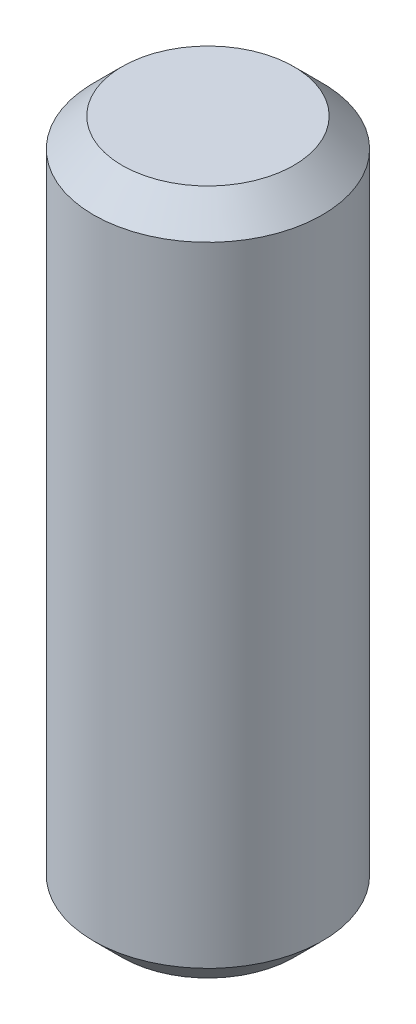
ISO-10303-21;
HEADER;
FILE_DESCRIPTION(('STEP AP214'),'2;1');
FILE_NAME('part.step','',(''),(''),'','','');
FILE_SCHEMA(('AUTOMOTIVE_DESIGN { 1 0 10303 214 1 1 1 1 }'));
ENDSEC;
DATA;
#1=APPLICATION_CONTEXT('core data for automotive mechanical design processes');
#2=APPLICATION_PROTOCOL_DEFINITION('international standard','automotive_design',2000,#1);
#3=PRODUCT_CONTEXT('',#1,'mechanical');
#4=PRODUCT('Part','Part','',(#3));
#5=PRODUCT_RELATED_PRODUCT_CATEGORY('part','',(#4));
#6=PRODUCT_DEFINITION_FORMATION('','',#4);
#7=PRODUCT_DEFINITION_CONTEXT('part definition',#1,'design');
#8=PRODUCT_DEFINITION('design','',#6,#7);
#9=PRODUCT_DEFINITION_SHAPE('','',#8);
#10=(LENGTH_UNIT() NAMED_UNIT(*) SI_UNIT(.MILLI.,.METRE.));
#11=(NAMED_UNIT(*) PLANE_ANGLE_UNIT() SI_UNIT($,.RADIAN.));
#12=(NAMED_UNIT(*) SI_UNIT($,.STERADIAN.) SOLID_ANGLE_UNIT());
#13=UNCERTAINTY_MEASURE_WITH_UNIT(LENGTH_MEASURE(1.E-05),#10,'distance_accuracy_value','');
#14=(GEOMETRIC_REPRESENTATION_CONTEXT(3) GLOBAL_UNCERTAINTY_ASSIGNED_CONTEXT((#13)) GLOBAL_UNIT_ASSIGNED_CONTEXT((#10,
#11,#12)) REPRESENTATION_CONTEXT('',''));
#15=CARTESIAN_POINT('',(0.,0.,0.));
#16=DIRECTION('',(0.,0.,1.));
#17=DIRECTION('',(1.,0.,0.));
#18=AXIS2_PLACEMENT_3D('',#15,#16,#17);
#19=CARTESIAN_POINT('',(0.,12.,0.));
#20=DIRECTION('',(0.,-1.,0.));
#21=DIRECTION('',(0.,0.,-1.));
#22=AXIS2_PLACEMENT_3D('',#19,#20,#21);
#23=CYLINDRICAL_SURFACE('',#22,2.);
#24=CARTESIAN_POINT('',(0.,0.500000000000002,0.));
#25=DIRECTION('',(0.,1.,0.));
#26=DIRECTION('',(0.,0.,1.));
#27=AXIS2_PLACEMENT_3D('',#24,#25,#26);
#28=CIRCLE('',#27,2.);
#29=CARTESIAN_POINT('',(0.,0.500000000000002,2.));
#30=VERTEX_POINT('',#29);
#31=EDGE_CURVE('E51',#30,#30,#28,.T.);
#32=ORIENTED_EDGE('',*,*,#31,.T.);
#33=EDGE_LOOP('',(#32));
#34=FACE_BOUND('',#33,.T.);
#35=CARTESIAN_POINT('',(0.,11.5,0.));
#36=DIRECTION('',(0.,1.,0.));
#37=DIRECTION('',(0.,0.,1.));
#38=AXIS2_PLACEMENT_3D('',#35,#36,#37);
#39=CIRCLE('',#38,2.);
#40=CARTESIAN_POINT('',(0.,11.5,2.));
#41=VERTEX_POINT('',#40);
#42=EDGE_CURVE('E55',#41,#41,#39,.F.);
#43=ORIENTED_EDGE('',*,*,#42,.T.);
#44=EDGE_LOOP('',(#43));
#45=FACE_BOUND('',#44,.T.);
#46=ADVANCED_FACE('F39',(#34,#45),#23,.T.);
#47=CARTESIAN_POINT('',(0.,12.,0.));
#48=DIRECTION('',(0.,1.,0.));
#49=DIRECTION('',(0.,0.,1.));
#50=AXIS2_PLACEMENT_3D('',#47,#48,#49);
#51=PLANE('',#50);
#52=CARTESIAN_POINT('',(0.,12.,0.));
#53=DIRECTION('',(0.,1.,0.));
#54=DIRECTION('',(0.,0.,1.));
#55=AXIS2_PLACEMENT_3D('',#52,#53,#54);
#56=CIRCLE('',#55,1.5);
#57=CARTESIAN_POINT('',(0.,12.,1.5));
#58=VERTEX_POINT('',#57);
#59=EDGE_CURVE('E10',#58,#58,#56,.T.);
#60=ORIENTED_EDGE('',*,*,#59,.T.);
#61=EDGE_LOOP('',(#60));
#62=FACE_BOUND('',#61,.T.);
#63=ADVANCED_FACE('F71',(#62),#51,.T.);
#64=CARTESIAN_POINT('',(0.,0.,0.));
#65=DIRECTION('',(0.,1.,0.));
#66=DIRECTION('',(0.,0.,1.));
#67=AXIS2_PLACEMENT_3D('',#64,#65,#66);
#68=PLANE('',#67);
#69=CARTESIAN_POINT('',(0.,0.,0.));
#70=DIRECTION('',(0.,1.,0.));
#71=DIRECTION('',(0.,0.,1.));
#72=AXIS2_PLACEMENT_3D('',#69,#70,#71);
#73=CIRCLE('',#72,1.5);
#74=CARTESIAN_POINT('',(0.,0.,1.5));
#75=VERTEX_POINT('',#74);
#76=EDGE_CURVE('E47',#75,#75,#73,.F.);
#77=ORIENTED_EDGE('',*,*,#76,.T.);
#78=EDGE_LOOP('',(#77));
#79=FACE_BOUND('',#78,.T.);
#80=ADVANCED_FACE('F68',(#79),#68,.F.);
#81=CARTESIAN_POINT('',(0.,0.500000000000002,0.));
#82=DIRECTION('',(0.,1.,0.));
#83=DIRECTION('',(0.,0.,1.));
#84=AXIS2_PLACEMENT_3D('',#81,#82,#83);
#85=CONICAL_SURFACE('',#84,2.,0.78539816339745);
#86=ORIENTED_EDGE('',*,*,#76,.F.);
#87=EDGE_LOOP('',(#86));
#88=FACE_BOUND('',#87,.T.);
#89=ORIENTED_EDGE('',*,*,#31,.F.);
#90=EDGE_LOOP('',(#89));
#91=FACE_BOUND('',#90,.T.);
#92=ADVANCED_FACE('F64',(#88,#91),#85,.T.);
#93=CARTESIAN_POINT('',(0.,12.,0.));
#94=DIRECTION('',(0.,-1.,0.));
#95=DIRECTION('',(0.,0.,-1.));
#96=AXIS2_PLACEMENT_3D('',#93,#94,#95);
#97=CONICAL_SURFACE('',#96,1.5,0.785398163397447);
#98=ORIENTED_EDGE('',*,*,#42,.F.);
#99=EDGE_LOOP('',(#98));
#100=FACE_BOUND('',#99,.T.);
#101=ORIENTED_EDGE('',*,*,#59,.F.);
#102=EDGE_LOOP('',(#101));
#103=FACE_BOUND('',#102,.T.);
#104=ADVANCED_FACE('F42',(#100,#103),#97,.T.);
#105=CLOSED_SHELL('',(#46,#63,#80,#92,#104));
#106=MANIFOLD_SOLID_BREP('B2',#105);
#107=ADVANCED_BREP_SHAPE_REPRESENTATION('',(#18,#106),#14);
#108=SHAPE_DEFINITION_REPRESENTATION(#9,#107);
ENDSEC;
END-ISO-10303-21;
